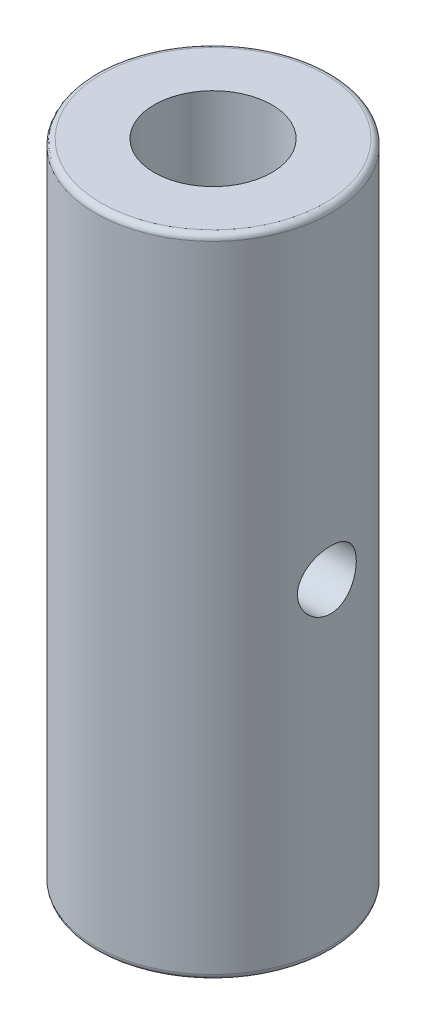
ISO-10303-21;
HEADER;
FILE_DESCRIPTION(('STEP AP214'),'2;1');
FILE_NAME('part.step','',(''),(''),'','','');
FILE_SCHEMA(('AUTOMOTIVE_DESIGN { 1 0 10303 214 1 1 1 1 }'));
ENDSEC;
DATA;
#1=APPLICATION_CONTEXT('core data for automotive mechanical design processes');
#2=APPLICATION_PROTOCOL_DEFINITION('international standard','automotive_design',2000,#1);
#3=PRODUCT_CONTEXT('',#1,'mechanical');
#4=PRODUCT('Part','Part','',(#3));
#5=PRODUCT_RELATED_PRODUCT_CATEGORY('part','',(#4));
#6=PRODUCT_DEFINITION_FORMATION('','',#4);
#7=PRODUCT_DEFINITION_CONTEXT('part definition',#1,'design');
#8=PRODUCT_DEFINITION('design','',#6,#7);
#9=PRODUCT_DEFINITION_SHAPE('','',#8);
#10=(LENGTH_UNIT() NAMED_UNIT(*) SI_UNIT(.MILLI.,.METRE.));
#11=(NAMED_UNIT(*) PLANE_ANGLE_UNIT() SI_UNIT($,.RADIAN.));
#12=(NAMED_UNIT(*) SI_UNIT($,.STERADIAN.) SOLID_ANGLE_UNIT());
#13=UNCERTAINTY_MEASURE_WITH_UNIT(LENGTH_MEASURE(1.E-05),#10,'distance_accuracy_value','');
#14=(GEOMETRIC_REPRESENTATION_CONTEXT(3) GLOBAL_UNCERTAINTY_ASSIGNED_CONTEXT((#13)) GLOBAL_UNIT_ASSIGNED_CONTEXT((#10,
#11,#12)) REPRESENTATION_CONTEXT('',''));
#15=CARTESIAN_POINT('',(0.,0.,0.));
#16=DIRECTION('',(0.,0.,1.));
#17=DIRECTION('',(1.,0.,0.));
#18=AXIS2_PLACEMENT_3D('',#15,#16,#17);
#19=CARTESIAN_POINT('',(0.,110.,0.));
#20=DIRECTION('',(0.,1.,0.));
#21=DIRECTION('',(0.,0.,1.));
#22=AXIS2_PLACEMENT_3D('',#19,#20,#21);
#23=PLANE('',#22);
#24=CARTESIAN_POINT('',(0.,110.,0.));
#25=DIRECTION('',(0.,1.,0.));
#26=DIRECTION('',(0.,0.,1.));
#27=AXIS2_PLACEMENT_3D('',#24,#25,#26);
#28=CIRCLE('',#27,19.);
#29=CARTESIAN_POINT('',(0.,110.,19.));
#30=VERTEX_POINT('',#29);
#31=EDGE_CURVE('E10',#30,#30,#28,.T.);
#32=ORIENTED_EDGE('',*,*,#31,.T.);
#33=EDGE_LOOP('',(#32));
#34=FACE_BOUND('',#33,.T.);
#35=CARTESIAN_POINT('',(0.,110.,0.));
#36=DIRECTION('',(0.,1.,0.));
#37=DIRECTION('',(0.,0.,1.));
#38=AXIS2_PLACEMENT_3D('',#35,#36,#37);
#39=CIRCLE('',#38,10.);
#40=CARTESIAN_POINT('',(0.,110.,10.));
#41=VERTEX_POINT('',#40);
#42=EDGE_CURVE('E59',#41,#41,#39,.T.);
#43=ORIENTED_EDGE('',*,*,#42,.F.);
#44=EDGE_LOOP('',(#43));
#45=FACE_BOUND('',#44,.T.);
#46=ADVANCED_FACE('F39',(#34,#45),#23,.T.);
#47=CARTESIAN_POINT('',(0.,0.,0.));
#48=DIRECTION('',(0.,1.,0.));
#49=DIRECTION('',(0.,0.,1.));
#50=AXIS2_PLACEMENT_3D('',#47,#48,#49);
#51=PLANE('',#50);
#52=CARTESIAN_POINT('',(0.,0.,0.));
#53=DIRECTION('',(0.,1.,0.));
#54=DIRECTION('',(0.,0.,1.));
#55=AXIS2_PLACEMENT_3D('',#52,#53,#54);
#56=CIRCLE('',#55,19.);
#57=CARTESIAN_POINT('',(0.,0.,19.));
#58=VERTEX_POINT('',#57);
#59=EDGE_CURVE('E46',#58,#58,#56,.F.);
#60=ORIENTED_EDGE('',*,*,#59,.T.);
#61=EDGE_LOOP('',(#60));
#62=FACE_BOUND('',#61,.T.);
#63=CARTESIAN_POINT('',(0.,0.,0.));
#64=DIRECTION('',(0.,1.,0.));
#65=DIRECTION('',(0.,0.,1.));
#66=AXIS2_PLACEMENT_3D('',#63,#64,#65);
#67=CIRCLE('',#66,10.);
#68=CARTESIAN_POINT('',(0.,0.,10.));
#69=VERTEX_POINT('',#68);
#70=EDGE_CURVE('E120',#69,#69,#67,.T.);
#71=ORIENTED_EDGE('',*,*,#70,.T.);
#72=EDGE_LOOP('',(#71));
#73=FACE_BOUND('',#72,.T.);
#74=ADVANCED_FACE('F102',(#62,#73),#51,.F.);
#75=CARTESIAN_POINT('',(0.,110.,0.));
#76=DIRECTION('',(0.,-1.,0.));
#77=DIRECTION('',(0.,0.,-1.));
#78=AXIS2_PLACEMENT_3D('',#75,#76,#77);
#79=CYLINDRICAL_SURFACE('',#78,20.);
#80=CARTESIAN_POINT('',(0.,1.,0.));
#81=DIRECTION('',(0.,1.,0.));
#82=DIRECTION('',(0.,0.,1.));
#83=AXIS2_PLACEMENT_3D('',#80,#81,#82);
#84=CIRCLE('',#83,20.);
#85=CARTESIAN_POINT('',(0.,1.,20.));
#86=VERTEX_POINT('',#85);
#87=EDGE_CURVE('E50',#86,#86,#84,.T.);
#88=ORIENTED_EDGE('',*,*,#87,.T.);
#89=EDGE_LOOP('',(#88));
#90=FACE_BOUND('',#89,.T.);
#91=CARTESIAN_POINT('',(0.,109.,0.));
#92=DIRECTION('',(0.,1.,0.));
#93=DIRECTION('',(0.,0.,1.));
#94=AXIS2_PLACEMENT_3D('',#91,#92,#93);
#95=CIRCLE('',#94,20.);
#96=CARTESIAN_POINT('',(0.,109.,20.));
#97=VERTEX_POINT('',#96);
#98=EDGE_CURVE('E54',#97,#97,#95,.F.);
#99=ORIENTED_EDGE('',*,*,#98,.T.);
#100=EDGE_LOOP('',(#99));
#101=FACE_BOUND('',#100,.T.);
#102=CARTESIAN_POINT('',(-20.,50.,0.));
#103=CARTESIAN_POINT('',(-19.9999953289337,50.0000077524605,-0.276253628899103));
#104=CARTESIAN_POINT('',(-19.9942192710609,50.0229718359126,-0.552593859435876));
#105=CARTESIAN_POINT('',(-19.9717371276631,50.11408383769,-1.09735441256844));
#106=CARTESIAN_POINT('',(-19.9550248473325,50.1822573651262,-1.3657701562358));
#107=CARTESIAN_POINT('',(-19.9125208777344,50.361464178207,-1.88673624060859));
#108=CARTESIAN_POINT('',(-19.8867400947353,50.4724459957176,-2.13930521143334));
#109=CARTESIAN_POINT('',(-19.8288447935874,50.7339379668161,-2.62224043968142));
#110=CARTESIAN_POINT('',(-19.7967300618052,50.8844494537299,-2.85260594782921));
#111=CARTESIAN_POINT('',(-19.7289137863898,51.2240026321806,-3.28933975766972));
#112=CARTESIAN_POINT('',(-19.6931569049375,51.4137052498635,-3.49518563353685));
#113=CARTESIAN_POINT('',(-19.6224540039312,51.8248406830301,-3.87249642401106));
#114=CARTESIAN_POINT('',(-19.5875080763289,52.0462770764898,-4.0439574564973));
#115=CARTESIAN_POINT('',(-19.5218258566056,52.51865075579,-4.35008847599658));
#116=CARTESIAN_POINT('',(-19.4911598154937,52.7699774360291,-4.4841740530838));
#117=CARTESIAN_POINT('',(-19.4383164939339,53.2924947055334,-4.70798969516914));
#118=CARTESIAN_POINT('',(-19.4161378564806,53.5636821111067,-4.79772685146713));
#119=CARTESIAN_POINT('',(-19.3833492232108,54.1124783273389,-4.92851612268255));
#120=CARTESIAN_POINT('',(-19.372516366567,54.38984965346,-4.97050756110684));
#121=CARTESIAN_POINT('',(-19.362978748653,54.9478952299978,-5.00753925022136));
#122=CARTESIAN_POINT('',(-19.3642720142643,55.2285689356405,-5.0025871393937));
#123=CARTESIAN_POINT('',(-19.3786401838939,55.7780526924845,-4.94662174879902));
#124=CARTESIAN_POINT('',(-19.3914287669098,56.0469854048844,-4.89672780063545));
#125=CARTESIAN_POINT('',(-19.426890322369,56.5725368363702,-4.75408062300998));
#126=CARTESIAN_POINT('',(-19.4495639989746,56.8291546767631,-4.66132434023131));
#127=CARTESIAN_POINT('',(-19.5025037968553,57.3257933875071,-4.43463159312395));
#128=CARTESIAN_POINT('',(-19.5328442489939,57.5656205726319,-4.3002888907764));
#129=CARTESIAN_POINT('',(-19.5976570281997,58.0197290325227,-3.99452092004982));
#130=CARTESIAN_POINT('',(-19.6321300778209,58.2340058268908,-3.82308916269612));
#131=CARTESIAN_POINT('',(-19.7025293513297,58.637345385648,-3.44221141560407));
#132=CARTESIAN_POINT('',(-19.7384689826,58.8255149668712,-3.23182086055287));
#133=CARTESIAN_POINT('',(-19.8068655192919,59.164070808213,-2.78203972501233));
#134=CARTESIAN_POINT('',(-19.8393223183136,59.3144559142119,-2.54264825902648));
#135=CARTESIAN_POINT('',(-19.897257736473,59.5735019540813,-2.04038629560464));
#136=CARTESIAN_POINT('',(-19.9227120042576,59.6820178008481,-1.77743797736208));
#137=CARTESIAN_POINT('',(-19.9635972330472,59.8530576856986,-1.23625336047628));
#138=CARTESIAN_POINT('',(-19.9790301113094,59.9155905213938,-0.958019997168283));
#139=CARTESIAN_POINT('',(-19.9978499757125,59.9915252185295,-0.401799901300092));
#140=CARTESIAN_POINT('',(-20.0015351169426,60.006143420251,-0.12398906662737));
#141=CARTESIAN_POINT('',(-19.9972934938151,59.9891699931484,0.430109582671692));
#142=CARTESIAN_POINT('',(-19.9893677747284,59.9575825240029,0.706397532148652));
#143=CARTESIAN_POINT('',(-19.9629860375783,59.8500969720287,1.24538089592163));
#144=CARTESIAN_POINT('',(-19.9446878061929,59.7748624550768,1.50821706322917));
#145=CARTESIAN_POINT('',(-19.899623554472,59.5829763865718,2.01752430817505));
#146=CARTESIAN_POINT('',(-19.8728566789995,59.4663206522893,2.26399373010884));
#147=CARTESIAN_POINT('',(-19.8131102642072,59.1925462370844,2.73841044809943));
#148=CARTESIAN_POINT('',(-19.7800289122193,59.0347462920114,2.96595147278588));
#149=CARTESIAN_POINT('',(-19.7114836395924,58.6840336373428,3.39175537881104));
#150=CARTESIAN_POINT('',(-19.676019308434,58.4911148679412,3.59001319657751));
#151=CARTESIAN_POINT('',(-19.6056318986475,58.0699934638543,3.95663522690826));
#152=CARTESIAN_POINT('',(-19.57074347274,57.8410409900013,4.12414622540362));
#153=CARTESIAN_POINT('',(-19.5064292794107,57.3575578851049,4.41836919671214));
#154=CARTESIAN_POINT('',(-19.4770032695336,57.1030283900992,4.54508298053823));
#155=CARTESIAN_POINT('',(-19.4272698238587,56.5769809253119,4.75317140202426));
#156=CARTESIAN_POINT('',(-19.4069085073875,56.3055745722898,4.83481465547784));
#157=CARTESIAN_POINT('',(-19.3775581342603,55.7523012071515,4.95115219981056));
#158=CARTESIAN_POINT('',(-19.3685665905607,55.4704364966046,4.98585675825595));
#159=CARTESIAN_POINT('',(-19.3631633735661,54.9129299204403,5.00679530111928));
#160=CARTESIAN_POINT('',(-19.366397756045,54.6373418828544,4.99439299259115));
#161=CARTESIAN_POINT('',(-19.3842636317313,54.092320371061,4.92459092769654));
#162=CARTESIAN_POINT('',(-19.3988948958968,53.8228867732805,4.86719207562106));
#163=CARTESIAN_POINT('',(-19.4377086899187,53.2993051364666,4.70977106481402));
#164=CARTESIAN_POINT('',(-19.461833841343,53.0450756492041,4.61000468226918));
#165=CARTESIAN_POINT('',(-19.5169251906949,52.5567820576162,4.37088304534897));
#166=CARTESIAN_POINT('',(-19.5478923373231,52.3227207560423,4.23152230011362));
#167=CARTESIAN_POINT('',(-19.6141878088207,51.8748179033279,3.91289249545747));
#168=CARTESIAN_POINT('',(-19.6496088277351,51.6616630885872,3.73267720970761));
#169=CARTESIAN_POINT('',(-19.7202675748663,51.2681765173483,3.33929790396569));
#170=CARTESIAN_POINT('',(-19.755505257566,51.08785256629,3.12612607087046));
#171=CARTESIAN_POINT('',(-19.8225885215915,50.7619623047847,2.66822528900866));
#172=CARTESIAN_POINT('',(-19.8543611121963,50.6170846210948,2.42299474105463));
#173=CARTESIAN_POINT('',(-19.9101641658366,50.3708417901982,1.91088686503491));
#174=CARTESIAN_POINT('',(-19.9342001733259,50.2694454645049,1.6440252114558));
#175=CARTESIAN_POINT('',(-19.9682686521849,50.1280938989012,1.14803417747824));
#176=CARTESIAN_POINT('',(-19.9800861684231,50.0801625231552,0.921267236360231));
#177=CARTESIAN_POINT('',(-19.9959535077316,50.0161135212602,0.463020238454278));
#178=CARTESIAN_POINT('',(-20.0000039150298,49.9999935023157,0.231540537475388));
#179=CARTESIAN_POINT('',(-20.,50.,0.));
#180=B_SPLINE_CURVE_WITH_KNOTS('',3,(#102,#103,#104,#105,#106,#107,#108,#109,#110,#111,#112,
#113,#114,#115,#116,#117,#118,#119,#120,#121,#122,#123,#124,#125,#126,#127,#128,#129,#130,#131,
#132,#133,#134,#135,#136,#137,#138,#139,#140,#141,#142,#143,#144,#145,#146,#147,#148,#149,#150,
#151,#152,#153,#154,#155,#156,#157,#158,#159,#160,#161,#162,#163,#164,#165,#166,#167,#168,#169,
#170,#171,#172,#173,#174,#175,#176,#177,#178,#179),.UNSPECIFIED.,.T.,.F.,(4,2,2,2,2,2,2,2,2,2,2,
2,2,2,2,2,2,2,2,2,2,2,2,2,2,2,2,2,2,2,2,2,2,2,2,2,2,2,4),(0.,0.827912374906298,1.65629412587966,
2.48368300762035,3.31109980056443,4.1538145145713,4.99662431933539,5.85195491819355,
6.70714870564561,7.54520983670233,8.38313460386726,9.20074990034462,10.0184234489786,
10.84435092924,11.6704230279828,12.5200500324113,13.3697029853856,14.2222743004145,
15.0746824563988,15.9052769650866,16.7357967038688,17.5540091505786,18.372304244187,
19.2051195856224,20.0380787670447,20.8914836402599,21.7448506250943,22.5930751539527,
23.4411141086095,24.2647926801851,25.0884546987996,25.9072133522466,26.7260856048284,
27.5663192139287,28.4067523259457,29.2624061835847,30.1174454609767,30.8114080983367,
31.5053185350331),.UNSPECIFIED.);
#181=CARTESIAN_POINT('',(-20.,50.,0.));
#182=VERTEX_POINT('',#181);
#183=EDGE_CURVE('E93',#182,#182,#180,.T.);
#184=ORIENTED_EDGE('',*,*,#183,.T.);
#185=EDGE_LOOP('',(#184));
#186=FACE_BOUND('',#185,.T.);
#187=CARTESIAN_POINT('',(19.3649167310371,55.,-5.));
#188=CARTESIAN_POINT('',(19.3649220017572,54.7238984981468,-4.99999215718614));
#189=CARTESIAN_POINT('',(19.3708861202919,54.447710202643,-4.9770524909953));
#190=CARTESIAN_POINT('',(19.3940372398513,53.903264843653,-4.88604625092758));
#191=CARTESIAN_POINT('',(19.4112307724326,53.6350124910636,-4.81795341348421));
#192=CARTESIAN_POINT('',(19.454774491923,53.1143929236256,-4.63898239926408));
#193=CARTESIAN_POINT('',(19.4811128538092,52.8620056892286,-4.52815945570898));
#194=CARTESIAN_POINT('',(19.5399638405752,52.3793782949202,-4.26704228252277));
#195=CARTESIAN_POINT('',(19.5724767275698,52.1491390758396,-4.11674637712137));
#196=CARTESIAN_POINT('',(19.6408143271125,51.7122767094756,-3.77741685462377));
#197=CARTESIAN_POINT('',(19.6766919524607,51.5062127992999,-3.5876737754081));
#198=CARTESIAN_POINT('',(19.7472575103059,51.1284772112793,-3.17636412820133));
#199=CARTESIAN_POINT('',(19.7819453313278,50.9568087487565,-2.95479458836061));
#200=CARTESIAN_POINT('',(19.8468083104116,50.6504490647374,-2.48229040215791));
#201=CARTESIAN_POINT('',(19.8769137480118,50.5163072236771,-2.23098915239024));
#202=CARTESIAN_POINT('',(19.9286162385197,50.2923807116938,-1.70852636858552));
#203=CARTESIAN_POINT('',(19.9502145466869,50.202589496169,-1.43736777158388));
#204=CARTESIAN_POINT('',(19.9820951769636,50.0717043308428,-0.888717517508322));
#205=CARTESIAN_POINT('',(19.9925978768862,50.0296607113468,-0.611465439097951));
#206=CARTESIAN_POINT('',(20.001871882146,49.9924832414489,-0.0536576385255367));
#207=CARTESIAN_POINT('',(20.0006449219342,49.9973424555808,0.226897589076142));
#208=CARTESIAN_POINT('',(19.9867618990705,50.0531497005003,0.776761235861931));
#209=CARTESIAN_POINT('',(19.9743600468169,50.1030726501077,1.04618107800532));
#210=CARTESIAN_POINT('',(19.9398167304977,50.245942540097,1.57269123706845));
#211=CARTESIAN_POINT('',(19.917674747971,50.338891770755,1.82978089685226));
#212=CARTESIAN_POINT('',(19.8657501940157,50.566005141374,2.32703351750896));
#213=CARTESIAN_POINT('',(19.8359003938928,50.7005340893229,2.56702254883225));
#214=CARTESIAN_POINT('',(19.7717980762013,51.0067113582331,3.02137811170272));
#215=CARTESIAN_POINT('',(19.7375447930809,51.1783661371233,3.23574017542854));
#216=CARTESIAN_POINT('',(19.6672742753585,51.5594174839626,3.63887017542374));
#217=CARTESIAN_POINT('',(19.6312343903978,51.7697097846874,3.82678839537208));
#218=CARTESIAN_POINT('',(19.5623008704546,52.2191999470887,4.16488187981901));
#219=CARTESIAN_POINT('',(19.5294073825696,52.4583991590125,4.31505538024471));
#220=CARTESIAN_POINT('',(19.4704099361798,52.9605800682742,4.57394064510187));
#221=CARTESIAN_POINT('',(19.4443396728207,53.2236714605262,4.68244783480346));
#222=CARTESIAN_POINT('',(19.4023728014569,53.7651709360502,4.85342810313207));
#223=CARTESIAN_POINT('',(19.3864740164534,54.0435757279375,4.91591103275196));
#224=CARTESIAN_POINT('',(19.3671071205401,54.5999190030819,4.99165927734366));
#225=CARTESIAN_POINT('',(19.3633217796434,54.877675586688,5.0061809478414));
#226=CARTESIAN_POINT('',(19.3677468671892,55.4316438731646,4.98903398102716));
#227=CARTESIAN_POINT('',(19.3759561913782,55.7078557158973,4.95736959569876));
#228=CARTESIAN_POINT('',(19.403141639727,56.2462285298987,4.84985092787733));
#229=CARTESIAN_POINT('',(19.421939404858,56.5085454531388,4.77472813656403));
#230=CARTESIAN_POINT('',(19.4680143652488,57.0168629157062,4.5832361633407));
#231=CARTESIAN_POINT('',(19.4952925649262,57.2628615181115,4.46686209542494));
#232=CARTESIAN_POINT('',(19.5559227419123,57.7368825557339,4.19354133587326));
#233=CARTESIAN_POINT('',(19.5893833721454,57.964457680086,4.0358435076713));
#234=CARTESIAN_POINT('',(19.6583416614217,58.3903767256029,3.68530146467224));
#235=CARTESIAN_POINT('',(19.693839654566,58.5887158333002,3.49245147402719));
#236=CARTESIAN_POINT('',(19.7639480606356,58.9556220851419,3.07131360492364));
#237=CARTESIAN_POINT('',(19.7985140412376,59.1233201250976,2.84225976265797));
#238=CARTESIAN_POINT('',(19.8619443322737,59.4178717339025,2.35851341347338));
#239=CARTESIAN_POINT('',(19.890808940079,59.5447274332164,2.10382224478796));
#240=CARTESIAN_POINT('',(19.9394023147665,59.7528920690559,1.57779100865546));
#241=CARTESIAN_POINT('',(19.9591966004482,59.8345285687581,1.30658690513941));
#242=CARTESIAN_POINT('',(19.9877058679158,59.9509206692168,0.753748801594036));
#243=CARTESIAN_POINT('',(19.9964229878684,59.9856853174781,0.472116825206203));
#244=CARTESIAN_POINT('',(20.0017084704403,60.0068379478777,-0.0854176322166151));
#245=CARTESIAN_POINT('',(19.9985989439994,59.994508545477,-0.361269134830108));
#246=CARTESIAN_POINT('',(19.9812948228722,59.9247608635283,-0.906837482073753));
#247=CARTESIAN_POINT('',(19.9671005578584,59.8673439249342,-1.17655450890464));
#248=CARTESIAN_POINT('',(19.9292716426945,59.7097389011457,-1.70085517822387));
#249=CARTESIAN_POINT('',(19.9056882251196,59.6097827334281,-1.95551247290432));
#250=CARTESIAN_POINT('',(19.8515644456829,59.3701471049021,-2.44458526520812));
#251=CARTESIAN_POINT('',(19.8210232069379,59.2304626366476,-2.67899820632817));
#252=CARTESIAN_POINT('',(19.7553624840144,58.9114238300193,-3.12700964211651));
#253=CARTESIAN_POINT('',(19.7201508470832,58.7311992854809,-3.33997494149167));
#254=CARTESIAN_POINT('',(19.6495324528595,58.3378857401133,-3.73307510136751));
#255=CARTESIAN_POINT('',(19.6141256483651,58.1247884194442,-3.91320162538295));
#256=CARTESIAN_POINT('',(19.5463737922751,57.6669929290527,-4.23881013235915));
#257=CARTESIAN_POINT('',(19.5140981836644,57.4217793831737,-4.38358309708189));
#258=CARTESIAN_POINT('',(19.4571977747414,56.9097225506259,-4.62963448292735));
#259=CARTESIAN_POINT('',(19.4325674116607,56.6428951695308,-4.73094454876076));
#260=CARTESIAN_POINT('',(19.3975954375369,56.1471149408242,-4.87211264285501));
#261=CARTESIAN_POINT('',(19.3854331501749,55.9205341780693,-4.91996585298439));
#262=CARTESIAN_POINT('',(19.369091929131,55.4626556550116,-4.98391146285885));
#263=CARTESIAN_POINT('',(19.3649123144554,55.231358298778,-5.00000657185875));
#264=CARTESIAN_POINT('',(19.3649167310371,55.,-5.));
#265=B_SPLINE_CURVE_WITH_KNOTS('',3,(#187,#188,#189,#190,#191,#192,#193,#194,#195,#196,#197,
#198,#199,#200,#201,#202,#203,#204,#205,#206,#207,#208,#209,#210,#211,#212,#213,#214,#215,#216,
#217,#218,#219,#220,#221,#222,#223,#224,#225,#226,#227,#228,#229,#230,#231,#232,#233,#234,#235,
#236,#237,#238,#239,#240,#241,#242,#243,#244,#245,#246,#247,#248,#249,#250,#251,#252,#253,#254,
#255,#256,#257,#258,#259,#260,#261,#262,#263,#264),.UNSPECIFIED.,.T.,.F.,(4,2,2,2,2,2,2,2,2,2,2,
2,2,2,2,2,2,2,2,2,2,2,2,2,2,2,2,2,2,2,2,2,2,2,2,2,2,2,4),(0.,0.827454883472277,1.65539148285733,
2.48226145433205,3.30916653510956,4.15247908385952,4.99587042959733,5.8510299279584,
6.70606319694185,7.54377501990693,8.38136297332041,9.20036525377894,10.0194111344957,
10.8458574850889,11.6724477093783,12.5214093314382,13.370410623996,14.2235286401917,
15.0764640026417,15.9068714953348,16.7372025438257,17.5539481003338,18.370790428578,
19.2036569173328,20.0366603778505,20.890506619456,21.7443083145407,22.5918414562882,
23.4392109783304,24.2636689226988,25.0881023476892,25.9080975313438,26.7281961149111,
27.567941931791,28.4079006314598,29.2635295458734,30.118534427551,30.8119565437652,
31.505319502209),.UNSPECIFIED.);
#266=CARTESIAN_POINT('',(19.3649167310371,55.,-5.));
#267=VERTEX_POINT('',#266);
#268=EDGE_CURVE('E68',#267,#267,#265,.T.);
#269=ORIENTED_EDGE('',*,*,#268,.T.);
#270=EDGE_LOOP('',(#269));
#271=FACE_BOUND('',#270,.T.);
#272=ADVANCED_FACE('F98',(#90,#101,#186,#271),#79,.T.);
#273=CARTESIAN_POINT('',(0.,110.,0.));
#274=DIRECTION('',(0.,-1.,0.));
#275=DIRECTION('',(0.,0.,-1.));
#276=AXIS2_PLACEMENT_3D('',#273,#274,#275);
#277=CYLINDRICAL_SURFACE('',#276,10.);
#278=CARTESIAN_POINT('',(-8.66025403784439,55.,-5.));
#279=CARTESIAN_POINT('',(-8.66025482828518,55.1303316567961,-4.99999937774203));
#280=CARTESIAN_POINT('',(-8.66320639320551,55.2606749083469,-4.99489703999514));
#281=CARTESIAN_POINT('',(-8.67490215579888,55.5203552182528,-4.97455590140419));
#282=CARTESIAN_POINT('',(-8.68364905023327,55.6496917797997,-4.95931238151411));
#283=CARTESIAN_POINT('',(-8.70662912382781,55.9065135375637,-4.91885673177676));
#284=CARTESIAN_POINT('',(-8.72087090589727,56.033995503785,-4.89362896878987));
#285=CARTESIAN_POINT('',(-8.75432466229382,56.2860174644883,-4.83352579766962));
#286=CARTESIAN_POINT('',(-8.77353879767271,56.410556154035,-4.79864619425836));
#287=CARTESIAN_POINT('',(-8.83745677232208,56.7771112075341,-4.6805346614708));
#288=CARTESIAN_POINT('',(-8.88859880977519,57.0137323207336,-4.58356144574886));
#289=CARTESIAN_POINT('',(-9.00213659941723,57.4671619547889,-4.35632594214356));
#290=CARTESIAN_POINT('',(-9.06453296036385,57.6839694029475,-4.22606185336435));
#291=CARTESIAN_POINT('',(-9.19984032823,58.1115106177474,-3.92334549410417));
#292=CARTESIAN_POINT('',(-9.27319410334728,58.3202685823228,-3.74829976483493));
#293=CARTESIAN_POINT('',(-9.41860822234891,58.7070690515488,-3.36622943427774));
#294=CARTESIAN_POINT('',(-9.49066790509843,58.8850962349664,-3.15918897852744));
#295=CARTESIAN_POINT('',(-9.59484443095073,59.1312264286858,-2.82033206345807));
#296=CARTESIAN_POINT('',(-9.62993554487431,59.2119131521005,-2.69838192133586));
#297=CARTESIAN_POINT('',(-9.69680156689125,59.3626286654218,-2.44722131237053));
#298=CARTESIAN_POINT('',(-9.72857779329811,59.4326616973628,-2.31801376345375));
#299=CARTESIAN_POINT('',(-9.78789520431625,59.5613762312932,-2.05317391777883));
#300=CARTESIAN_POINT('',(-9.81543747951443,59.6200606574798,-1.91754328730047));
#301=CARTESIAN_POINT('',(-9.86547242365067,59.7254310158281,-1.64079696990286));
#302=CARTESIAN_POINT('',(-9.88796562891049,59.7721182224333,-1.49968186742444));
#303=CARTESIAN_POINT('',(-9.92580359946711,59.8500155125182,-1.22330436599559));
#304=CARTESIAN_POINT('',(-9.94154295735176,59.8820901096035,-1.08833937324155));
#305=CARTESIAN_POINT('',(-9.96761571585522,59.9349664286038,-0.815709188800214));
#306=CARTESIAN_POINT('',(-9.97794964280152,59.9557692480603,-0.678044261360659));
#307=CARTESIAN_POINT('',(-9.99290900237256,59.9858199114167,-0.401217055741361));
#308=CARTESIAN_POINT('',(-9.99753719051025,59.9950733329762,-0.262055533104013));
#309=CARTESIAN_POINT('',(-10.0009568128334,60.0019143333982,0.0166220416280669));
#310=CARTESIAN_POINT('',(-9.99974860411976,59.9995026259935,0.15613807151018));
#311=CARTESIAN_POINT('',(-9.99189263105535,59.9837693970487,0.422158287145513));
#312=CARTESIAN_POINT('',(-9.9857287219252,59.9714182292176,0.548735568605433));
#313=CARTESIAN_POINT('',(-9.9687211507105,59.937167427645,0.800312348574867));
#314=CARTESIAN_POINT('',(-9.95787601100424,59.915264778974,0.925311336065685));
#315=CARTESIAN_POINT('',(-9.93176736436012,59.8621537757626,1.17280363036128));
#316=CARTESIAN_POINT('',(-9.91650533549045,59.8309485341379,1.29529776073403));
#317=CARTESIAN_POINT('',(-9.88192155120269,59.7595523484822,1.53706747687734));
#318=CARTESIAN_POINT('',(-9.86259824100145,59.7193579627522,1.6563418102202));
#319=CARTESIAN_POINT('',(-9.79859222392452,59.5846254604358,2.01140340124728));
#320=CARTESIAN_POINT('',(-9.74822622058319,59.4766310411066,2.24122720645223));
#321=CARTESIAN_POINT('',(-9.63687815372567,59.2286703075067,2.67992393299636));
#322=CARTESIAN_POINT('',(-9.57589229137331,59.088692546844,2.88878931500038));
#323=CARTESIAN_POINT('',(-9.44222356886893,58.7655365262267,3.30085071454948));
#324=CARTESIAN_POINT('',(-9.36897995679248,58.5795253968794,3.5016445201989));
#325=CARTESIAN_POINT('',(-9.22270586177089,58.1770108060787,3.87054772569916));
#326=CARTESIAN_POINT('',(-9.14967558498934,57.9604841030917,4.03863197852248));
#327=CARTESIAN_POINT('',(-9.04390911775424,57.6088064627185,4.2679539578839));
#328=CARTESIAN_POINT('',(-9.00829977481543,57.4829490688498,4.34240098162072));
#329=CARTESIAN_POINT('',(-8.94051483957135,57.2244861217296,4.48030007564995));
#330=CARTESIAN_POINT('',(-8.90833780332,57.0918834411214,4.54375677655288));
#331=CARTESIAN_POINT('',(-8.84860631442917,56.8207965096454,4.65901104656178));
#332=CARTESIAN_POINT('',(-8.82104906525582,56.6823158810192,4.71081567564999));
#333=CARTESIAN_POINT('',(-8.7716484423619,56.4003786539485,4.80217514780264));
#334=CARTESIAN_POINT('',(-8.74980428958556,56.2569227369748,4.84173166119403));
#335=CARTESIAN_POINT('',(-8.71426171459813,55.9777430649249,4.90539138118897));
#336=CARTESIAN_POINT('',(-8.7000553284825,55.8423062664424,4.93047005719824));
#337=CARTESIAN_POINT('',(-8.67788216659553,55.5693280921951,4.96939299432912));
#338=CARTESIAN_POINT('',(-8.66991462570621,55.4317869766089,4.98323863305272));
#339=CARTESIAN_POINT('',(-8.66056020235633,55.1558845075408,4.99947854378905));
#340=CARTESIAN_POINT('',(-8.65916956150024,55.01752366777,5.00187935599941));
#341=CARTESIAN_POINT('',(-8.66301922537735,54.7411790950675,4.99520900229025));
#342=CARTESIAN_POINT('',(-8.66825908252539,54.6031953373112,4.98613861072294));
#343=CARTESIAN_POINT('',(-8.68421505193303,54.3439119206006,4.95828928039379));
#344=CARTESIAN_POINT('',(-8.69426699139328,54.2224432856653,4.94068517767344));
#345=CARTESIAN_POINT('',(-8.71910498639122,53.9815824240837,4.89671673345791));
#346=CARTESIAN_POINT('',(-8.73389250003321,53.8621908489265,4.87034969372092));
#347=CARTESIAN_POINT('',(-8.7846960742619,53.5082899585571,4.77850297980869));
#348=CARTESIAN_POINT('',(-8.82716454630259,53.2778857081681,4.7002591459757));
#349=CARTESIAN_POINT('',(-8.92681241600885,52.8229067643173,4.50823244687956));
#350=CARTESIAN_POINT('',(-8.98458205429472,52.5990963080479,4.39297142446301));
#351=CARTESIAN_POINT('',(-9.10780608277643,52.1726622544196,4.1314342135104));
#352=CARTESIAN_POINT('',(-9.1732644129012,51.9700496209225,3.9851420924436));
#353=CARTESIAN_POINT('',(-9.31439795768909,51.5651085963624,3.64419701683803));
#354=CARTESIAN_POINT('',(-9.39032093861059,51.3660355161201,3.44577250062108));
#355=CARTESIAN_POINT('',(-9.53671997076951,51.0029175331527,3.01697632238968));
#356=CARTESIAN_POINT('',(-9.60719417697592,50.8388844626049,2.78659391213233));
#357=CARTESIAN_POINT('',(-9.7041941861448,50.6209905262288,2.41774074756936));
#358=CARTESIAN_POINT('',(-9.73542921288424,50.5523379001797,2.28903769990884));
#359=CARTESIAN_POINT('',(-9.79367711332059,50.4262434813459,2.02535752273872));
#360=CARTESIAN_POINT('',(-9.82069185600805,50.3687967231238,1.89038320507347));
#361=CARTESIAN_POINT('',(-9.86968940022035,50.2657820915434,1.61516754079525));
#362=CARTESIAN_POINT('',(-9.89167460130352,50.2202085521106,1.47492874316051));
#363=CARTESIAN_POINT('',(-9.92995088678441,50.1414909239825,1.19024723850078));
#364=CARTESIAN_POINT('',(-9.94624264638291,50.1083453613854,1.04580503217189));
#365=CARTESIAN_POINT('',(-9.97139931839171,50.0574049663759,0.767401441682128));
#366=CARTESIAN_POINT('',(-9.98080865626407,50.0384803973572,0.633694933854985));
#367=CARTESIAN_POINT('',(-9.99424478074505,50.0115065468182,0.364924207537131));
#368=CARTESIAN_POINT('',(-9.9982719832244,50.0034564250429,0.229860094759438));
#369=CARTESIAN_POINT('',(-10.0008314531461,49.9983368228188,-0.0404881253987263));
#370=CARTESIAN_POINT('',(-9.999365319798,50.0012641466371,-0.175772157294892));
#371=CARTESIAN_POINT('',(-9.99098333266103,50.0180525477526,-0.445485239489122));
#372=CARTESIAN_POINT('',(-9.98406762889855,50.0319133240524,-0.579914313221433));
#373=CARTESIAN_POINT('',(-9.96560870935097,50.0691176794173,-0.838004211928026));
#374=CARTESIAN_POINT('',(-9.95440210269674,50.0917728342268,-0.961788818118172));
#375=CARTESIAN_POINT('',(-9.92767317989821,50.1462131555377,-1.20687032491422));
#376=CARTESIAN_POINT('',(-9.91214948953036,50.1780012293566,-1.32816642014825));
#377=CARTESIAN_POINT('',(-9.859612953764,50.2866082442713,-1.68709586409475));
#378=CARTESIAN_POINT('',(-9.81661817605329,50.3767019250861,-1.91998814282436));
#379=CARTESIAN_POINT('',(-9.71629432734439,50.5936422217195,-2.37715486497024));
#380=CARTESIAN_POINT('',(-9.65843082383811,50.7218959654493,-2.60063468941493));
#381=CARTESIAN_POINT('',(-9.53440669320975,51.0097903051846,-3.02386422902505));
#382=CARTESIAN_POINT('',(-9.46824226032902,51.169445317032,-3.22360297720279));
#383=CARTESIAN_POINT('',(-9.32643278468726,51.5339751711068,-3.61456788757425));
#384=CARTESIAN_POINT('',(-9.25049954016331,51.7417690335459,-3.80296860888284));
#385=CARTESIAN_POINT('',(-9.1031442101187,52.1872970477145,-4.14333626823683));
#386=CARTESIAN_POINT('',(-9.03172615645363,52.4250574065678,-4.29527097306547));
#387=CARTESIAN_POINT('',(-8.93341291054548,52.8042196667176,-4.49442606762734));
#388=CARTESIAN_POINT('',(-8.90168698468314,52.936626328209,-4.55675683233957));
#389=CARTESIAN_POINT('',(-8.8428797220414,53.2072554637669,-4.66985426801939));
#390=CARTESIAN_POINT('',(-8.81579599491154,53.3454748987939,-4.72062689492349));
#391=CARTESIAN_POINT('',(-8.76742025858706,53.6264078742926,-4.80987708806143));
#392=CARTESIAN_POINT('',(-8.74611337114853,53.7691087930855,-4.8483862843261));
#393=CARTESIAN_POINT('',(-8.71014784774039,54.0580921444705,-4.91270711070743));
#394=CARTESIAN_POINT('',(-8.69548456411172,54.2043719976095,-4.93852761851021));
#395=CARTESIAN_POINT('',(-8.67647541111358,54.4589978869293,-4.97182308032502));
#396=CARTESIAN_POINT('',(-8.67040719452513,54.5668242162268,-4.98237929832923));
#397=CARTESIAN_POINT('',(-8.66229604436744,54.7830976599821,-4.99646825199979));
#398=CARTESIAN_POINT('',(-8.66025338008092,54.8915448154826,-5.00000051781052));
#399=CARTESIAN_POINT('',(-8.66025403784439,55.,-5.));
#400=B_SPLINE_CURVE_WITH_KNOTS('',3,(#278,#279,#280,#281,#282,#283,#284,#285,#286,#287,#288,
#289,#290,#291,#292,#293,#294,#295,#296,#297,#298,#299,#300,#301,#302,#303,#304,#305,#306,#307,
#308,#309,#310,#311,#312,#313,#314,#315,#316,#317,#318,#319,#320,#321,#322,#323,#324,#325,#326,
#327,#328,#329,#330,#331,#332,#333,#334,#335,#336,#337,#338,#339,#340,#341,#342,#343,#344,#345,
#346,#347,#348,#349,#350,#351,#352,#353,#354,#355,#356,#357,#358,#359,#360,#361,#362,#363,#364,
#365,#366,#367,#368,#369,#370,#371,#372,#373,#374,#375,#376,#377,#378,#379,#380,#381,#382,#383,
#384,#385,#386,#387,#388,#389,#390,#391,#392,#393,#394,#395,#396,#397,#398,#399),.UNSPECIFIED.,
.T.,.F.,(4,2,2,2,2,2,2,2,2,2,2,2,2,2,2,2,2,2,2,2,2,2,2,2,2,2,2,2,2,2,2,2,2,2,2,2,2,2,2,2,2,2,2,
2,2,2,2,2,2,2,2,2,2,2,2,2,2,2,2,2,4),(0.,0.390882384556485,0.781946787673764,1.17362595011563,
1.56547562833135,2.34415414386117,3.12287479153474,3.96582272680015,4.80918971852755,
5.25982992442626,5.71029022430251,6.16063429887937,6.61093051439736,7.02920538093652,
7.44743951241415,7.86547158389039,8.28347807833437,8.66500933177613,9.0466611030143,
9.42818530565609,9.80985583438832,10.5829669450729,11.3563551760292,12.202849781349,
13.0499926207968,13.501002097322,13.9518210829089,14.4023661773263,14.8528498019288,
15.2676702585959,15.6824398346428,16.0969723603126,16.5114769048702,16.8804871114428,
17.2496110473149,17.9873544979167,18.759266696418,19.5315761871159,20.4012390551442,
21.2711951250237,21.7182117808489,22.1650299066984,22.6116344121698,23.0581859356052,
23.4637505264203,23.8692837779652,24.2746989806128,24.6801030225936,25.0586722294313,
25.4373620814588,26.1940875134848,26.9831783738578,27.7726323429201,28.6406529303875,
29.5094379801419,29.9581473751205,30.4066250230036,30.8539364017616,31.3009343703532,
31.6261844795329,31.9514563450476),.UNSPECIFIED.);
#401=CARTESIAN_POINT('',(-8.66025403784439,55.,-5.));
#402=VERTEX_POINT('',#401);
#403=EDGE_CURVE('E60',#402,#402,#400,.T.);
#404=ORIENTED_EDGE('',*,*,#403,.F.);
#405=EDGE_LOOP('',(#404));
#406=FACE_BOUND('',#405,.T.);
#407=CARTESIAN_POINT('',(8.66025403784439,55.,-5.));
#408=CARTESIAN_POINT('',(8.66025482828518,54.8696683432039,-4.99999937774203));
#409=CARTESIAN_POINT('',(8.66320639320551,54.7393250916531,-4.99489703999514));
#410=CARTESIAN_POINT('',(8.67490215579888,54.4796447817472,-4.97455590140419));
#411=CARTESIAN_POINT('',(8.68364905023327,54.3503082202003,-4.95931238151411));
#412=CARTESIAN_POINT('',(8.70662912382781,54.0934864624363,-4.91885673177676));
#413=CARTESIAN_POINT('',(8.72087090589727,53.966004496215,-4.89362896878987));
#414=CARTESIAN_POINT('',(8.75432466229382,53.7139825355117,-4.83352579766962));
#415=CARTESIAN_POINT('',(8.77353879767271,53.589443845965,-4.79864619425836));
#416=CARTESIAN_POINT('',(8.83745677232208,53.2228887924659,-4.6805346614708));
#417=CARTESIAN_POINT('',(8.88859880977519,52.9862676792664,-4.58356144574886));
#418=CARTESIAN_POINT('',(9.00213659941723,52.5328380452111,-4.35632594214356));
#419=CARTESIAN_POINT('',(9.06453296036385,52.3160305970525,-4.22606185336435));
#420=CARTESIAN_POINT('',(9.19984032823,51.8884893822526,-3.92334549410417));
#421=CARTESIAN_POINT('',(9.27319410334728,51.6797314176772,-3.74829976483492));
#422=CARTESIAN_POINT('',(9.41860822234892,51.2929309484512,-3.36622943427774));
#423=CARTESIAN_POINT('',(9.49066790509843,51.1149037650336,-3.15918897852743));
#424=CARTESIAN_POINT('',(9.59484443095073,50.8687735713142,-2.82033206345807));
#425=CARTESIAN_POINT('',(9.62993554487431,50.7880868478995,-2.69838192133586));
#426=CARTESIAN_POINT('',(9.69680156689125,50.6373713345782,-2.44722131237053));
#427=CARTESIAN_POINT('',(9.72857779329811,50.5673383026372,-2.31801376345375));
#428=CARTESIAN_POINT('',(9.78789520431625,50.4386237687068,-2.05317391777883));
#429=CARTESIAN_POINT('',(9.81543747951443,50.3799393425202,-1.91754328730047));
#430=CARTESIAN_POINT('',(9.86547242365067,50.2745689841719,-1.64079696990286));
#431=CARTESIAN_POINT('',(9.88796562891049,50.2278817775667,-1.49968186742444));
#432=CARTESIAN_POINT('',(9.92580359946711,50.1499844874818,-1.22330436599559));
#433=CARTESIAN_POINT('',(9.94154295735176,50.1179098903965,-1.08833937324155));
#434=CARTESIAN_POINT('',(9.96761571585522,50.0650335713962,-0.81570918880021));
#435=CARTESIAN_POINT('',(9.97794964280152,50.0442307519397,-0.678044261360656));
#436=CARTESIAN_POINT('',(9.99290900237256,50.0141800885833,-0.401217055741358));
#437=CARTESIAN_POINT('',(9.99753719051025,50.0049266670238,-0.262055533104011));
#438=CARTESIAN_POINT('',(10.0009568128334,49.9980856666018,0.016622041628068));
#439=CARTESIAN_POINT('',(9.99974860411976,50.0004973740065,0.156138071510181));
#440=CARTESIAN_POINT('',(9.99189263105534,50.0162306029513,0.422158287145513));
#441=CARTESIAN_POINT('',(9.9857287219252,50.0285817707824,0.548735568605433));
#442=CARTESIAN_POINT('',(9.9687211507105,50.062832572355,0.800312348574868));
#443=CARTESIAN_POINT('',(9.95787601100424,50.084735221026,0.925311336065686));
#444=CARTESIAN_POINT('',(9.93176736436012,50.1378462242374,1.17280363036128));
#445=CARTESIAN_POINT('',(9.91650533549045,50.1690514658621,1.29529776073403));
#446=CARTESIAN_POINT('',(9.88192155120269,50.2404476515178,1.53706747687734));
#447=CARTESIAN_POINT('',(9.86259824100145,50.2806420372478,1.6563418102202));
#448=CARTESIAN_POINT('',(9.79859222392452,50.4153745395642,2.01140340124728));
#449=CARTESIAN_POINT('',(9.74822622058319,50.5233689588934,2.24122720645223));
#450=CARTESIAN_POINT('',(9.63687815372567,50.7713296924933,2.67992393299636));
#451=CARTESIAN_POINT('',(9.57589229137331,50.911307453156,2.88878931500038));
#452=CARTESIAN_POINT('',(9.44222356886893,51.2344634737733,3.30085071454948));
#453=CARTESIAN_POINT('',(9.36897995679248,51.4204746031206,3.5016445201989));
#454=CARTESIAN_POINT('',(9.22270586177089,51.8229891939213,3.87054772569916));
#455=CARTESIAN_POINT('',(9.14967558498934,52.0395158969083,4.03863197852248));
#456=CARTESIAN_POINT('',(9.04390911775424,52.3911935372815,4.2679539578839));
#457=CARTESIAN_POINT('',(9.00829977481543,52.5170509311502,4.34240098162072));
#458=CARTESIAN_POINT('',(8.94051483957134,52.7755138782704,4.48030007564995));
#459=CARTESIAN_POINT('',(8.90833780331999,52.9081165588786,4.54375677655288));
#460=CARTESIAN_POINT('',(8.84860631442917,53.1792034903546,4.65901104656178));
#461=CARTESIAN_POINT('',(8.82104906525582,53.3176841189808,4.71081567564999));
#462=CARTESIAN_POINT('',(8.7716484423619,53.5996213460515,4.80217514780264));
#463=CARTESIAN_POINT('',(8.74980428958556,53.7430772630252,4.84173166119403));
#464=CARTESIAN_POINT('',(8.71426171459813,54.0222569350751,4.90539138118897));
#465=CARTESIAN_POINT('',(8.7000553284825,54.1576937335576,4.93047005719824));
#466=CARTESIAN_POINT('',(8.67788216659553,54.4306719078049,4.96939299432912));
#467=CARTESIAN_POINT('',(8.66991462570621,54.5682130233911,4.98323863305272));
#468=CARTESIAN_POINT('',(8.66056020235633,54.8441154924592,4.99947854378905));
#469=CARTESIAN_POINT('',(8.65916956150024,54.98247633223,5.00187935599941));
#470=CARTESIAN_POINT('',(8.66301922537735,55.2588209049325,4.99520900229025));
#471=CARTESIAN_POINT('',(8.66825908252539,55.3968046626888,4.98613861072294));
#472=CARTESIAN_POINT('',(8.68421505193303,55.6560880793994,4.95828928039379));
#473=CARTESIAN_POINT('',(8.69426699139328,55.7775567143347,4.94068517767344));
#474=CARTESIAN_POINT('',(8.71910498639122,56.0184175759163,4.89671673345791));
#475=CARTESIAN_POINT('',(8.73389250003321,56.1378091510735,4.87034969372092));
#476=CARTESIAN_POINT('',(8.7846960742619,56.4917100414429,4.77850297980869));
#477=CARTESIAN_POINT('',(8.82716454630259,56.7221142918319,4.7002591459757));
#478=CARTESIAN_POINT('',(8.92681241600885,57.1770932356827,4.50823244687956));
#479=CARTESIAN_POINT('',(8.98458205429472,57.4009036919521,4.39297142446301));
#480=CARTESIAN_POINT('',(9.10780608277643,57.8273377455804,4.1314342135104));
#481=CARTESIAN_POINT('',(9.1732644129012,58.0299503790775,3.9851420924436));
#482=CARTESIAN_POINT('',(9.31439795768909,58.4348914036376,3.64419701683803));
#483=CARTESIAN_POINT('',(9.39032093861059,58.6339644838799,3.44577250062108));
#484=CARTESIAN_POINT('',(9.53671997076951,58.9970824668473,3.01697632238968));
#485=CARTESIAN_POINT('',(9.60719417697592,59.1611155373951,2.78659391213233));
#486=CARTESIAN_POINT('',(9.7041941861448,59.3790094737712,2.41774074756936));
#487=CARTESIAN_POINT('',(9.73542921288424,59.4476620998203,2.28903769990884));
#488=CARTESIAN_POINT('',(9.79367711332059,59.5737565186541,2.02535752273872));
#489=CARTESIAN_POINT('',(9.82069185600805,59.6312032768762,1.89038320507347));
#490=CARTESIAN_POINT('',(9.86968940022035,59.7342179084566,1.61516754079525));
#491=CARTESIAN_POINT('',(9.89167460130352,59.7797914478894,1.47492874316051));
#492=CARTESIAN_POINT('',(9.92995088678441,59.8585090760175,1.19024723850078));
#493=CARTESIAN_POINT('',(9.94624264638291,59.8916546386146,1.04580503217189));
#494=CARTESIAN_POINT('',(9.97139931839171,59.9425950336241,0.767401441682128));
#495=CARTESIAN_POINT('',(9.98080865626407,59.9615196026428,0.633694933854984));
#496=CARTESIAN_POINT('',(9.99424478074505,59.9884934531818,0.36492420753713));
#497=CARTESIAN_POINT('',(9.9982719832244,59.9965435749571,0.229860094759438));
#498=CARTESIAN_POINT('',(10.0008314531461,60.0016631771812,-0.0404881253987262));
#499=CARTESIAN_POINT('',(9.999365319798,59.9987358533629,-0.175772157294892));
#500=CARTESIAN_POINT('',(9.99098333266103,59.9819474522474,-0.445485239489121));
#501=CARTESIAN_POINT('',(9.98406762889855,59.9680866759476,-0.579914313221433));
#502=CARTESIAN_POINT('',(9.96560870935097,59.9308823205827,-0.838004211928027));
#503=CARTESIAN_POINT('',(9.95440210269674,59.9082271657732,-0.961788818118173));
#504=CARTESIAN_POINT('',(9.92767317989821,59.8537868444623,-1.20687032491422));
#505=CARTESIAN_POINT('',(9.91214948953036,59.8219987706434,-1.32816642014825));
#506=CARTESIAN_POINT('',(9.859612953764,59.7133917557287,-1.68709586409475));
#507=CARTESIAN_POINT('',(9.81661817605329,59.6232980749139,-1.91998814282436));
#508=CARTESIAN_POINT('',(9.71629432734439,59.4063577782805,-2.37715486497024));
#509=CARTESIAN_POINT('',(9.65843082383811,59.2781040345507,-2.60063468941493));
#510=CARTESIAN_POINT('',(9.53440669320975,58.9902096948154,-3.02386422902505));
#511=CARTESIAN_POINT('',(9.46824226032902,58.830554682968,-3.22360297720279));
#512=CARTESIAN_POINT('',(9.32643278468726,58.4660248288932,-3.61456788757425));
#513=CARTESIAN_POINT('',(9.25049954016331,58.2582309664541,-3.80296860888284));
#514=CARTESIAN_POINT('',(9.1031442101187,57.8127029522855,-4.14333626823683));
#515=CARTESIAN_POINT('',(9.03172615645363,57.5749425934322,-4.29527097306547));
#516=CARTESIAN_POINT('',(8.93341291054548,57.1957803332824,-4.49442606762734));
#517=CARTESIAN_POINT('',(8.90168698468314,57.063373671791,-4.55675683233957));
#518=CARTESIAN_POINT('',(8.8428797220414,56.7927445362331,-4.66985426801939));
#519=CARTESIAN_POINT('',(8.81579599491154,56.6545251012061,-4.72062689492349));
#520=CARTESIAN_POINT('',(8.76742025858706,56.3735921257074,-4.80987708806143));
#521=CARTESIAN_POINT('',(8.74611337114853,56.2308912069145,-4.8483862843261));
#522=CARTESIAN_POINT('',(8.71014784774039,55.9419078555295,-4.91270711070743));
#523=CARTESIAN_POINT('',(8.69548456411172,55.7956280023905,-4.93852761851021));
#524=CARTESIAN_POINT('',(8.67647541111358,55.5410021130707,-4.97182308032502));
#525=CARTESIAN_POINT('',(8.67040719452513,55.4331757837732,-4.98237929832923));
#526=CARTESIAN_POINT('',(8.66229604436744,55.2169023400179,-4.99646825199979));
#527=CARTESIAN_POINT('',(8.66025338008092,55.1084551845174,-5.00000051781052));
#528=CARTESIAN_POINT('',(8.66025403784439,55.,-5.));
#529=B_SPLINE_CURVE_WITH_KNOTS('',3,(#407,#408,#409,#410,#411,#412,#413,#414,#415,#416,#417,
#418,#419,#420,#421,#422,#423,#424,#425,#426,#427,#428,#429,#430,#431,#432,#433,#434,#435,#436,
#437,#438,#439,#440,#441,#442,#443,#444,#445,#446,#447,#448,#449,#450,#451,#452,#453,#454,#455,
#456,#457,#458,#459,#460,#461,#462,#463,#464,#465,#466,#467,#468,#469,#470,#471,#472,#473,#474,
#475,#476,#477,#478,#479,#480,#481,#482,#483,#484,#485,#486,#487,#488,#489,#490,#491,#492,#493,
#494,#495,#496,#497,#498,#499,#500,#501,#502,#503,#504,#505,#506,#507,#508,#509,#510,#511,#512,
#513,#514,#515,#516,#517,#518,#519,#520,#521,#522,#523,#524,#525,#526,#527,#528),.UNSPECIFIED.,
.T.,.F.,(4,2,2,2,2,2,2,2,2,2,2,2,2,2,2,2,2,2,2,2,2,2,2,2,2,2,2,2,2,2,2,2,2,2,2,2,2,2,2,2,2,2,2,
2,2,2,2,2,2,2,2,2,2,2,2,2,2,2,2,2,4),(0.,0.390882384556485,0.781946787673771,1.17362595011564,
1.56547562833135,2.34415414386116,3.12287479153474,3.96582272680017,4.80918971852755,
5.25982992442626,5.71029022430251,6.16063429887937,6.61093051439736,7.02920538093652,
7.44743951241415,7.86547158389039,8.28347807833437,8.66500933177613,9.0466611030143,
9.42818530565609,9.80985583438832,10.5829669450729,11.3563551760292,12.202849781349,
13.0499926207968,13.501002097322,13.9518210829089,14.4023661773263,14.8528498019288,
15.2676702585959,15.6824398346427,16.0969723603126,16.5114769048702,16.8804871114428,
17.2496110473149,17.9873544979167,18.759266696418,19.5315761871159,20.4012390551442,
21.2711951250237,21.7182117808489,22.1650299066984,22.6116344121698,23.0581859356052,
23.4637505264203,23.8692837779652,24.2746989806128,24.6801030225936,25.0586722294313,
25.4373620814588,26.1940875134848,26.9831783738578,27.7726323429201,28.6406529303875,
29.5094379801419,29.9581473751206,30.4066250230037,30.8539364017616,31.3009343703532,
31.6261844795329,31.9514563450476),.UNSPECIFIED.);
#530=CARTESIAN_POINT('',(8.66025403784439,55.,-5.));
#531=VERTEX_POINT('',#530);
#532=EDGE_CURVE('E69',#531,#531,#529,.T.);
#533=ORIENTED_EDGE('',*,*,#532,.F.);
#534=EDGE_LOOP('',(#533));
#535=FACE_BOUND('',#534,.T.);
#536=ORIENTED_EDGE('',*,*,#42,.T.);
#537=EDGE_LOOP('',(#536));
#538=FACE_BOUND('',#537,.T.);
#539=ORIENTED_EDGE('',*,*,#70,.F.);
#540=EDGE_LOOP('',(#539));
#541=FACE_BOUND('',#540,.T.);
#542=ADVANCED_FACE('F74',(#406,#535,#538,#541),#277,.F.);
#543=CARTESIAN_POINT('',(-20.,55.,0.));
#544=DIRECTION('',(1.,0.,0.));
#545=DIRECTION('',(0.,0.,-1.));
#546=AXIS2_PLACEMENT_3D('',#543,#544,#545);
#547=CYLINDRICAL_SURFACE('',#546,5.);
#548=ORIENTED_EDGE('',*,*,#532,.T.);
#549=EDGE_LOOP('',(#548));
#550=FACE_BOUND('',#549,.T.);
#551=ORIENTED_EDGE('',*,*,#268,.F.);
#552=EDGE_LOOP('',(#551));
#553=FACE_BOUND('',#552,.T.);
#554=ADVANCED_FACE('F81',(#550,#553),#547,.F.);
#555=ORIENTED_EDGE('',*,*,#403,.T.);
#556=EDGE_LOOP('',(#555));
#557=FACE_BOUND('',#556,.T.);
#558=ORIENTED_EDGE('',*,*,#183,.F.);
#559=EDGE_LOOP('',(#558));
#560=FACE_BOUND('',#559,.T.);
#561=ADVANCED_FACE('F77',(#557,#560),#547,.F.);
#562=CARTESIAN_POINT('',(0.,1.,0.));
#563=DIRECTION('',(0.,1.,0.));
#564=DIRECTION('',(0.,0.,1.));
#565=AXIS2_PLACEMENT_3D('',#562,#563,#564);
#566=TOROIDAL_SURFACE('',#565,19.,1.);
#567=ORIENTED_EDGE('',*,*,#59,.F.);
#568=EDGE_LOOP('',(#567));
#569=FACE_BOUND('',#568,.T.);
#570=ORIENTED_EDGE('',*,*,#87,.F.);
#571=EDGE_LOOP('',(#570));
#572=FACE_BOUND('',#571,.T.);
#573=ADVANCED_FACE('F80',(#569,#572),#566,.T.);
#574=CARTESIAN_POINT('',(0.,109.,0.));
#575=DIRECTION('',(0.,1.,0.));
#576=DIRECTION('',(0.,0.,1.));
#577=AXIS2_PLACEMENT_3D('',#574,#575,#576);
#578=TOROIDAL_SURFACE('',#577,19.,1.);
#579=ORIENTED_EDGE('',*,*,#98,.F.);
#580=EDGE_LOOP('',(#579));
#581=FACE_BOUND('',#580,.T.);
#582=ORIENTED_EDGE('',*,*,#31,.F.);
#583=EDGE_LOOP('',(#582));
#584=FACE_BOUND('',#583,.T.);
#585=ADVANCED_FACE('F41',(#581,#584),#578,.T.);
#586=CLOSED_SHELL('',(#46,#74,#272,#542,#554,#561,#573,#585));
#587=MANIFOLD_SOLID_BREP('B2',#586);
#588=ADVANCED_BREP_SHAPE_REPRESENTATION('',(#18,#587),#14);
#589=SHAPE_DEFINITION_REPRESENTATION(#9,#588);
ENDSEC;
END-ISO-10303-21;
